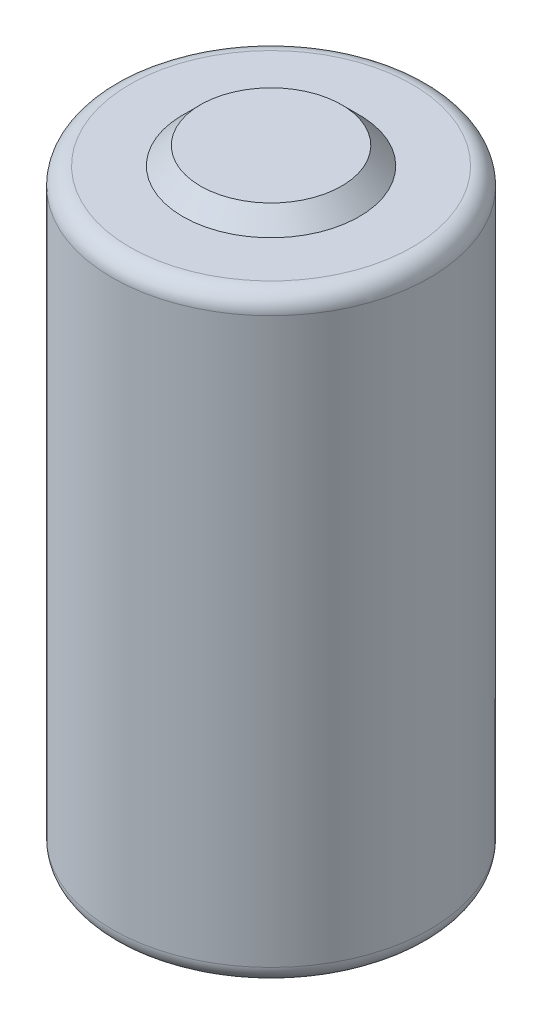
ISO-10303-21;
HEADER;
FILE_DESCRIPTION(('STEP AP214'),'2;1');
FILE_NAME('part.step','',(''),(''),'','','');
FILE_SCHEMA(('AUTOMOTIVE_DESIGN { 1 0 10303 214 1 1 1 1 }'));
ENDSEC;
DATA;
#1=APPLICATION_CONTEXT('core data for automotive mechanical design processes');
#2=APPLICATION_PROTOCOL_DEFINITION('international standard','automotive_design',2000,#1);
#3=PRODUCT_CONTEXT('',#1,'mechanical');
#4=PRODUCT('Part','Part','',(#3));
#5=PRODUCT_RELATED_PRODUCT_CATEGORY('part','',(#4));
#6=PRODUCT_DEFINITION_FORMATION('','',#4);
#7=PRODUCT_DEFINITION_CONTEXT('part definition',#1,'design');
#8=PRODUCT_DEFINITION('design','',#6,#7);
#9=PRODUCT_DEFINITION_SHAPE('','',#8);
#10=(LENGTH_UNIT() NAMED_UNIT(*) SI_UNIT(.MILLI.,.METRE.));
#11=(NAMED_UNIT(*) PLANE_ANGLE_UNIT() SI_UNIT($,.RADIAN.));
#12=(NAMED_UNIT(*) SI_UNIT($,.STERADIAN.) SOLID_ANGLE_UNIT());
#13=UNCERTAINTY_MEASURE_WITH_UNIT(LENGTH_MEASURE(1.E-05),#10,'distance_accuracy_value','');
#14=(GEOMETRIC_REPRESENTATION_CONTEXT(3) GLOBAL_UNCERTAINTY_ASSIGNED_CONTEXT((#13)) GLOBAL_UNIT_ASSIGNED_CONTEXT((#10,
#11,#12)) REPRESENTATION_CONTEXT('',''));
#15=CARTESIAN_POINT('',(0.,0.,0.));
#16=DIRECTION('',(0.,0.,1.));
#17=DIRECTION('',(1.,0.,0.));
#18=AXIS2_PLACEMENT_3D('',#15,#16,#17);
#19=CARTESIAN_POINT('',(0.,34.,0.));
#20=DIRECTION('',(0.,-1.,0.));
#21=DIRECTION('',(0.,0.,-1.));
#22=AXIS2_PLACEMENT_3D('',#19,#20,#21);
#23=CYLINDRICAL_SURFACE('',#22,9.);
#24=CARTESIAN_POINT('',(0.,1.,0.));
#25=DIRECTION('',(0.,1.,0.));
#26=DIRECTION('',(0.,0.,1.));
#27=AXIS2_PLACEMENT_3D('',#24,#25,#26);
#28=CIRCLE('',#27,9.);
#29=CARTESIAN_POINT('',(0.,1.,9.));
#30=VERTEX_POINT('',#29);
#31=EDGE_CURVE('E64',#30,#30,#28,.T.);
#32=ORIENTED_EDGE('',*,*,#31,.T.);
#33=EDGE_LOOP('',(#32));
#34=FACE_BOUND('',#33,.T.);
#35=CARTESIAN_POINT('',(0.,33.,0.));
#36=DIRECTION('',(0.,1.,0.));
#37=DIRECTION('',(0.,0.,1.));
#38=AXIS2_PLACEMENT_3D('',#35,#36,#37);
#39=CIRCLE('',#38,9.);
#40=CARTESIAN_POINT('',(0.,33.,9.));
#41=VERTEX_POINT('',#40);
#42=EDGE_CURVE('E70',#41,#41,#39,.F.);
#43=ORIENTED_EDGE('',*,*,#42,.T.);
#44=EDGE_LOOP('',(#43));
#45=FACE_BOUND('',#44,.T.);
#46=ADVANCED_FACE('F45',(#34,#45),#23,.T.);
#47=CARTESIAN_POINT('',(0.,34.,0.));
#48=DIRECTION('',(0.,1.,0.));
#49=DIRECTION('',(0.,0.,1.));
#50=AXIS2_PLACEMENT_3D('',#47,#48,#49);
#51=PLANE('',#50);
#52=CARTESIAN_POINT('',(0.,34.,0.));
#53=DIRECTION('',(0.,1.,0.));
#54=DIRECTION('',(0.,0.,1.));
#55=AXIS2_PLACEMENT_3D('',#52,#53,#54);
#56=CIRCLE('',#55,4.99999999999999);
#57=CARTESIAN_POINT('',(0.,34.,4.99999999999999));
#58=VERTEX_POINT('',#57);
#59=EDGE_CURVE('E10',#58,#58,#56,.F.);
#60=ORIENTED_EDGE('',*,*,#59,.T.);
#61=EDGE_LOOP('',(#60));
#62=FACE_BOUND('',#61,.T.);
#63=CARTESIAN_POINT('',(0.,34.,0.));
#64=DIRECTION('',(0.,1.,0.));
#65=DIRECTION('',(0.,0.,1.));
#66=AXIS2_PLACEMENT_3D('',#63,#64,#65);
#67=CIRCLE('',#66,8.);
#68=CARTESIAN_POINT('',(0.,34.,8.));
#69=VERTEX_POINT('',#68);
#70=EDGE_CURVE('E54',#69,#69,#67,.T.);
#71=ORIENTED_EDGE('',*,*,#70,.T.);
#72=EDGE_LOOP('',(#71));
#73=FACE_BOUND('',#72,.T.);
#74=ADVANCED_FACE('F90',(#62,#73),#51,.T.);
#75=CARTESIAN_POINT('',(0.,0.,0.));
#76=DIRECTION('',(0.,1.,0.));
#77=DIRECTION('',(0.,0.,1.));
#78=AXIS2_PLACEMENT_3D('',#75,#76,#77);
#79=PLANE('',#78);
#80=CARTESIAN_POINT('',(0.,0.,0.));
#81=DIRECTION('',(0.,1.,0.));
#82=DIRECTION('',(0.,0.,1.));
#83=AXIS2_PLACEMENT_3D('',#80,#81,#82);
#84=CIRCLE('',#83,8.);
#85=CARTESIAN_POINT('',(0.,0.,8.));
#86=VERTEX_POINT('',#85);
#87=EDGE_CURVE('E59',#86,#86,#84,.F.);
#88=ORIENTED_EDGE('',*,*,#87,.T.);
#89=EDGE_LOOP('',(#88));
#90=FACE_BOUND('',#89,.T.);
#91=ADVANCED_FACE('F96',(#90),#79,.F.);
#92=CARTESIAN_POINT('',(0.,35.,0.));
#93=DIRECTION('',(0.,1.,0.));
#94=DIRECTION('',(0.,0.,1.));
#95=AXIS2_PLACEMENT_3D('',#92,#93,#94);
#96=PLANE('',#95);
#97=CARTESIAN_POINT('',(0.,35.,0.));
#98=DIRECTION('',(0.,1.,0.));
#99=DIRECTION('',(0.,0.,1.));
#100=AXIS2_PLACEMENT_3D('',#97,#98,#99);
#101=CIRCLE('',#100,4.);
#102=CARTESIAN_POINT('',(0.,35.,4.));
#103=VERTEX_POINT('',#102);
#104=EDGE_CURVE('E74',#103,#103,#101,.T.);
#105=ORIENTED_EDGE('',*,*,#104,.T.);
#106=EDGE_LOOP('',(#105));
#107=FACE_BOUND('',#106,.T.);
#108=ADVANCED_FACE('F79',(#107),#96,.T.);
#109=CARTESIAN_POINT('',(0.,1.,0.));
#110=DIRECTION('',(0.,1.,0.));
#111=DIRECTION('',(0.,0.,1.));
#112=AXIS2_PLACEMENT_3D('',#109,#110,#111);
#113=TOROIDAL_SURFACE('',#112,8.,1.);
#114=ORIENTED_EDGE('',*,*,#87,.F.);
#115=EDGE_LOOP('',(#114));
#116=FACE_BOUND('',#115,.T.);
#117=ORIENTED_EDGE('',*,*,#31,.F.);
#118=EDGE_LOOP('',(#117));
#119=FACE_BOUND('',#118,.T.);
#120=ADVANCED_FACE('F87',(#116,#119),#113,.T.);
#121=CARTESIAN_POINT('',(0.,33.,0.));
#122=DIRECTION('',(0.,1.,0.));
#123=DIRECTION('',(0.,0.,1.));
#124=AXIS2_PLACEMENT_3D('',#121,#122,#123);
#125=TOROIDAL_SURFACE('',#124,8.,1.);
#126=ORIENTED_EDGE('',*,*,#42,.F.);
#127=EDGE_LOOP('',(#126));
#128=FACE_BOUND('',#127,.T.);
#129=ORIENTED_EDGE('',*,*,#70,.F.);
#130=EDGE_LOOP('',(#129));
#131=FACE_BOUND('',#130,.T.);
#132=ADVANCED_FACE('F82',(#128,#131),#125,.T.);
#133=CARTESIAN_POINT('',(0.,35.,0.));
#134=DIRECTION('',(0.,-1.,0.));
#135=DIRECTION('',(0.,0.,-1.));
#136=AXIS2_PLACEMENT_3D('',#133,#134,#135);
#137=CONICAL_SURFACE('',#136,4.,0.785398163397438);
#138=ORIENTED_EDGE('',*,*,#59,.F.);
#139=EDGE_LOOP('',(#138));
#140=FACE_BOUND('',#139,.T.);
#141=ORIENTED_EDGE('',*,*,#104,.F.);
#142=EDGE_LOOP('',(#141));
#143=FACE_BOUND('',#142,.T.);
#144=ADVANCED_FACE('F48',(#140,#143),#137,.T.);
#145=CLOSED_SHELL('',(#46,#74,#91,#108,#120,#132,#144));
#146=MANIFOLD_SOLID_BREP('B2',#145);
#147=ADVANCED_BREP_SHAPE_REPRESENTATION('',(#18,#146),#14);
#148=SHAPE_DEFINITION_REPRESENTATION(#9,#147);
ENDSEC;
END-ISO-10303-21;
